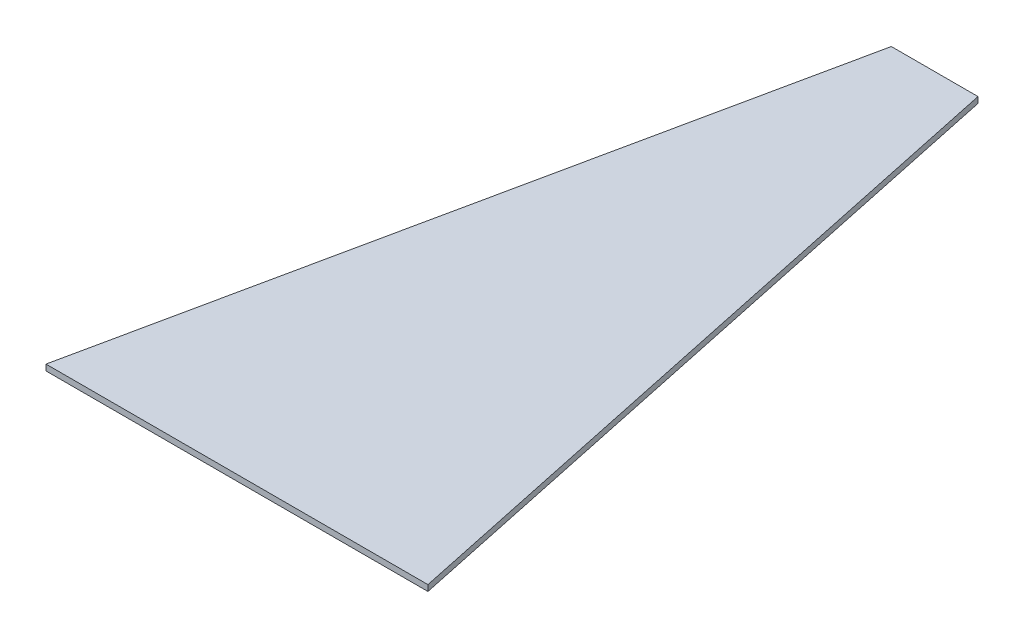
ISO-10303-21;
HEADER;
FILE_DESCRIPTION(('STEP AP214'),'2;1');
FILE_NAME('part.step','',(''),(''),'','','');
FILE_SCHEMA(('AUTOMOTIVE_DESIGN { 1 0 10303 214 1 1 1 1 }'));
ENDSEC;
DATA;
#1=APPLICATION_CONTEXT('core data for automotive mechanical design processes');
#2=APPLICATION_PROTOCOL_DEFINITION('international standard','automotive_design',2000,#1);
#3=PRODUCT_CONTEXT('',#1,'mechanical');
#4=PRODUCT('Part','Part','',(#3));
#5=PRODUCT_RELATED_PRODUCT_CATEGORY('part','',(#4));
#6=PRODUCT_DEFINITION_FORMATION('','',#4);
#7=PRODUCT_DEFINITION_CONTEXT('part definition',#1,'design');
#8=PRODUCT_DEFINITION('design','',#6,#7);
#9=PRODUCT_DEFINITION_SHAPE('','',#8);
#10=(LENGTH_UNIT() NAMED_UNIT(*) SI_UNIT(.MILLI.,.METRE.));
#11=(NAMED_UNIT(*) PLANE_ANGLE_UNIT() SI_UNIT($,.RADIAN.));
#12=(NAMED_UNIT(*) SI_UNIT($,.STERADIAN.) SOLID_ANGLE_UNIT());
#13=UNCERTAINTY_MEASURE_WITH_UNIT(LENGTH_MEASURE(1.E-05),#10,'distance_accuracy_value','');
#14=(GEOMETRIC_REPRESENTATION_CONTEXT(3) GLOBAL_UNCERTAINTY_ASSIGNED_CONTEXT((#13)) GLOBAL_UNIT_ASSIGNED_CONTEXT((#10,
#11,#12)) REPRESENTATION_CONTEXT('',''));
#15=CARTESIAN_POINT('',(0.,0.,0.));
#16=DIRECTION('',(0.,0.,1.));
#17=DIRECTION('',(1.,0.,0.));
#18=AXIS2_PLACEMENT_3D('',#15,#16,#17);
#19=CARTESIAN_POINT('',(128.024570596687,2.,0.));
#20=DIRECTION('',(-0.978336414596779,0.,0.207021399555504));
#21=DIRECTION('',(0.207021399555504,0.,0.978336414596779));
#22=AXIS2_PLACEMENT_3D('',#19,#20,#21);
#23=PLANE('',#22);
#24=DIRECTION('',(-0.207021399555504,0.,-0.978336414596779));
#25=VECTOR('',#24,1.);
#26=CARTESIAN_POINT('',(128.024570596687,0.,0.));
#27=LINE('',#26,#25);
#28=CARTESIAN_POINT('',(128.024570596687,0.,0.));
#29=VERTEX_POINT('',#28);
#30=CARTESIAN_POINT('',(78.5377397804236,0.,-233.863594461694));
#31=VERTEX_POINT('',#30);
#32=EDGE_CURVE('E107',#29,#31,#27,.T.);
#33=ORIENTED_EDGE('',*,*,#32,.T.);
#34=DIRECTION('',(0.,-1.,0.));
#35=VECTOR('',#34,1.);
#36=CARTESIAN_POINT('',(78.5377397804236,2.,-233.863594461694));
#37=LINE('',#36,#35);
#38=CARTESIAN_POINT('',(78.5377397804236,2.,-233.863594461694));
#39=VERTEX_POINT('',#38);
#40=EDGE_CURVE('E11',#39,#31,#37,.T.);
#41=ORIENTED_EDGE('',*,*,#40,.F.);
#42=DIRECTION('',(-0.207021399555504,0.,-0.978336414596779));
#43=VECTOR('',#42,1.);
#44=CARTESIAN_POINT('',(128.024570596687,2.,0.));
#45=LINE('',#44,#43);
#46=CARTESIAN_POINT('',(128.024570596687,2.,0.));
#47=VERTEX_POINT('',#46);
#48=EDGE_CURVE('E91',#47,#39,#45,.T.);
#49=ORIENTED_EDGE('',*,*,#48,.F.);
#50=DIRECTION('',(0.,-1.,0.));
#51=VECTOR('',#50,1.);
#52=CARTESIAN_POINT('',(128.024570596687,2.,0.));
#53=LINE('',#52,#51);
#54=EDGE_CURVE('E103',#47,#29,#53,.T.);
#55=ORIENTED_EDGE('',*,*,#54,.T.);
#56=EDGE_LOOP('',(#33,#41,#49,#55));
#57=FACE_BOUND('',#56,.T.);
#58=ADVANCED_FACE('F39',(#57),#23,.F.);
#59=CARTESIAN_POINT('',(78.5377397804236,2.,-233.863594461694));
#60=DIRECTION('',(0.,0.,1.));
#61=DIRECTION('',(1.,0.,0.));
#62=AXIS2_PLACEMENT_3D('',#59,#60,#61);
#63=PLANE('',#62);
#64=DIRECTION('',(-1.,0.,0.));
#65=VECTOR('',#64,1.);
#66=CARTESIAN_POINT('',(78.5377397804236,0.,-233.863594461694));
#67=LINE('',#66,#65);
#68=CARTESIAN_POINT('',(49.4868308162634,0.,-233.863594461694));
#69=VERTEX_POINT('',#68);
#70=EDGE_CURVE('E96',#31,#69,#67,.T.);
#71=ORIENTED_EDGE('',*,*,#70,.T.);
#72=DIRECTION('',(0.,-1.,0.));
#73=VECTOR('',#72,1.);
#74=CARTESIAN_POINT('',(49.4868308162634,2.,-233.863594461694));
#75=LINE('',#74,#73);
#76=CARTESIAN_POINT('',(49.4868308162634,2.,-233.863594461694));
#77=VERTEX_POINT('',#76);
#78=EDGE_CURVE('E48',#77,#69,#75,.T.);
#79=ORIENTED_EDGE('',*,*,#78,.F.);
#80=DIRECTION('',(-1.,0.,0.));
#81=VECTOR('',#80,1.);
#82=CARTESIAN_POINT('',(78.5377397804236,2.,-233.863594461694));
#83=LINE('',#82,#81);
#84=EDGE_CURVE('E86',#39,#77,#83,.T.);
#85=ORIENTED_EDGE('',*,*,#84,.F.);
#86=ORIENTED_EDGE('',*,*,#40,.T.);
#87=EDGE_LOOP('',(#71,#79,#85,#86));
#88=FACE_BOUND('',#87,.T.);
#89=ADVANCED_FACE('F95',(#88),#63,.F.);
#90=CARTESIAN_POINT('',(49.4868308162634,2.,-233.863594461694));
#91=DIRECTION('',(0.978336414596779,0.,0.207021399555504));
#92=DIRECTION('',(0.207021399555504,0.,-0.978336414596779));
#93=AXIS2_PLACEMENT_3D('',#90,#91,#92);
#94=PLANE('',#93);
#95=DIRECTION('',(-0.207021399555504,0.,0.978336414596779));
#96=VECTOR('',#95,1.);
#97=CARTESIAN_POINT('',(49.4868308162634,0.,-233.863594461694));
#98=LINE('',#97,#96);
#99=CARTESIAN_POINT('',(0.,0.,0.));
#100=VERTEX_POINT('',#99);
#101=EDGE_CURVE('E73',#69,#100,#98,.T.);
#102=ORIENTED_EDGE('',*,*,#101,.T.);
#103=DIRECTION('',(0.,-1.,0.));
#104=VECTOR('',#103,1.);
#105=CARTESIAN_POINT('',(0.,2.,0.));
#106=LINE('',#105,#104);
#107=CARTESIAN_POINT('',(0.,2.,0.));
#108=VERTEX_POINT('',#107);
#109=EDGE_CURVE('E98',#108,#100,#106,.T.);
#110=ORIENTED_EDGE('',*,*,#109,.F.);
#111=DIRECTION('',(-0.207021399555504,0.,0.978336414596779));
#112=VECTOR('',#111,1.);
#113=CARTESIAN_POINT('',(49.4868308162634,2.,-233.863594461694));
#114=LINE('',#113,#112);
#115=EDGE_CURVE('E89',#77,#108,#114,.T.);
#116=ORIENTED_EDGE('',*,*,#115,.F.);
#117=ORIENTED_EDGE('',*,*,#78,.T.);
#118=EDGE_LOOP('',(#102,#110,#116,#117));
#119=FACE_BOUND('',#118,.T.);
#120=ADVANCED_FACE('F99',(#119),#94,.F.);
#121=CARTESIAN_POINT('',(0.,2.,0.));
#122=DIRECTION('',(0.,0.,-1.));
#123=DIRECTION('',(-1.,0.,0.));
#124=AXIS2_PLACEMENT_3D('',#121,#122,#123);
#125=PLANE('',#124);
#126=DIRECTION('',(1.,0.,0.));
#127=VECTOR('',#126,1.);
#128=CARTESIAN_POINT('',(0.,0.,0.));
#129=LINE('',#128,#127);
#130=EDGE_CURVE('E79',#100,#29,#129,.T.);
#131=ORIENTED_EDGE('',*,*,#130,.T.);
#132=ORIENTED_EDGE('',*,*,#54,.F.);
#133=DIRECTION('',(1.,0.,0.));
#134=VECTOR('',#133,1.);
#135=CARTESIAN_POINT('',(0.,2.,0.));
#136=LINE('',#135,#134);
#137=EDGE_CURVE('E56',#108,#47,#136,.T.);
#138=ORIENTED_EDGE('',*,*,#137,.F.);
#139=ORIENTED_EDGE('',*,*,#109,.T.);
#140=EDGE_LOOP('',(#131,#132,#138,#139));
#141=FACE_BOUND('',#140,.T.);
#142=ADVANCED_FACE('F120',(#141),#125,.F.);
#143=CARTESIAN_POINT('',(0.,2.,0.));
#144=DIRECTION('',(0.,1.,0.));
#145=DIRECTION('',(0.,0.,1.));
#146=AXIS2_PLACEMENT_3D('',#143,#144,#145);
#147=PLANE('',#146);
#148=ORIENTED_EDGE('',*,*,#48,.T.);
#149=ORIENTED_EDGE('',*,*,#84,.T.);
#150=ORIENTED_EDGE('',*,*,#115,.T.);
#151=ORIENTED_EDGE('',*,*,#137,.T.);
#152=EDGE_LOOP('',(#148,#149,#150,#151));
#153=FACE_BOUND('',#152,.T.);
#154=ADVANCED_FACE('F87',(#153),#147,.T.);
#155=CARTESIAN_POINT('',(0.,0.,0.));
#156=DIRECTION('',(0.,1.,0.));
#157=DIRECTION('',(0.,0.,1.));
#158=AXIS2_PLACEMENT_3D('',#155,#156,#157);
#159=PLANE('',#158);
#160=ORIENTED_EDGE('',*,*,#32,.F.);
#161=ORIENTED_EDGE('',*,*,#130,.F.);
#162=ORIENTED_EDGE('',*,*,#101,.F.);
#163=ORIENTED_EDGE('',*,*,#70,.F.);
#164=EDGE_LOOP('',(#160,#161,#162,#163));
#165=FACE_BOUND('',#164,.T.);
#166=ADVANCED_FACE('F123',(#165),#159,.F.);
#167=CLOSED_SHELL('',(#58,#89,#120,#142,#154,#166));
#168=MANIFOLD_SOLID_BREP('B2',#167);
#169=ADVANCED_BREP_SHAPE_REPRESENTATION('',(#18,#168),#14);
#170=SHAPE_DEFINITION_REPRESENTATION(#9,#169);
ENDSEC;
END-ISO-10303-21;
